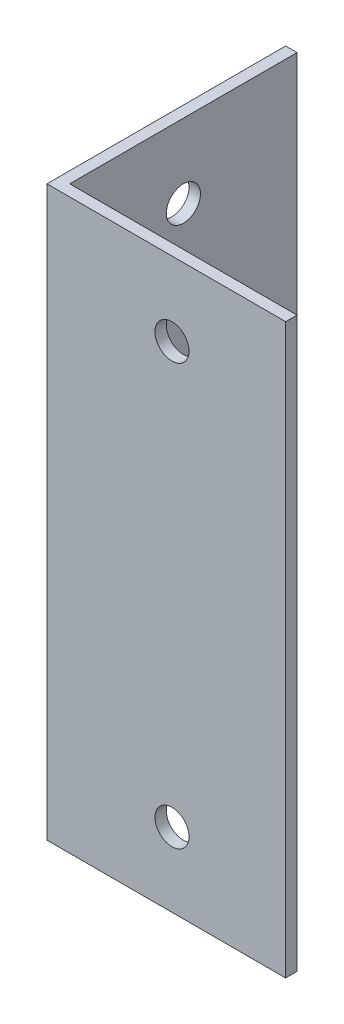
ISO-10303-21;
HEADER;
FILE_DESCRIPTION(('STEP AP214'),'2;1');
FILE_NAME('part.step','',(''),(''),'','','');
FILE_SCHEMA(('AUTOMOTIVE_DESIGN { 1 0 10303 214 1 1 1 1 }'));
ENDSEC;
DATA;
#1=APPLICATION_CONTEXT('core data for automotive mechanical design processes');
#2=APPLICATION_PROTOCOL_DEFINITION('international standard','automotive_design',2000,#1);
#3=PRODUCT_CONTEXT('',#1,'mechanical');
#4=PRODUCT('Part','Part','',(#3));
#5=PRODUCT_RELATED_PRODUCT_CATEGORY('part','',(#4));
#6=PRODUCT_DEFINITION_FORMATION('','',#4);
#7=PRODUCT_DEFINITION_CONTEXT('part definition',#1,'design');
#8=PRODUCT_DEFINITION('design','',#6,#7);
#9=PRODUCT_DEFINITION_SHAPE('','',#8);
#10=(LENGTH_UNIT() NAMED_UNIT(*) SI_UNIT(.MILLI.,.METRE.));
#11=(NAMED_UNIT(*) PLANE_ANGLE_UNIT() SI_UNIT($,.RADIAN.));
#12=(NAMED_UNIT(*) SI_UNIT($,.STERADIAN.) SOLID_ANGLE_UNIT());
#13=UNCERTAINTY_MEASURE_WITH_UNIT(LENGTH_MEASURE(1.E-05),#10,'distance_accuracy_value','');
#14=(GEOMETRIC_REPRESENTATION_CONTEXT(3) GLOBAL_UNCERTAINTY_ASSIGNED_CONTEXT((#13)) GLOBAL_UNIT_ASSIGNED_CONTEXT((#10,
#11,#12)) REPRESENTATION_CONTEXT('',''));
#15=CARTESIAN_POINT('',(0.,0.,0.));
#16=DIRECTION('',(0.,0.,1.));
#17=DIRECTION('',(1.,0.,0.));
#18=AXIS2_PLACEMENT_3D('',#15,#16,#17);
#19=CARTESIAN_POINT('',(21.,50.,0.));
#20=DIRECTION('',(0.,0.,-1.));
#21=DIRECTION('',(-1.,0.,0.));
#22=AXIS2_PLACEMENT_3D('',#19,#20,#21);
#23=PLANE('',#22);
#24=CARTESIAN_POINT('',(11.,6.50000000000001,0.));
#25=DIRECTION('',(0.,0.,-1.));
#26=DIRECTION('',(-1.,0.,0.));
#27=AXIS2_PLACEMENT_3D('',#24,#25,#26);
#28=CIRCLE('',#27,1.5);
#29=CARTESIAN_POINT('',(9.50000000000001,6.50000000000001,0.));
#30=VERTEX_POINT('',#29);
#31=EDGE_CURVE('E161',#30,#30,#28,.F.);
#32=ORIENTED_EDGE('',*,*,#31,.F.);
#33=EDGE_LOOP('',(#32));
#34=FACE_BOUND('',#33,.T.);
#35=CARTESIAN_POINT('',(11.,43.5,0.));
#36=DIRECTION('',(0.,0.,-1.));
#37=DIRECTION('',(-1.,0.,0.));
#38=AXIS2_PLACEMENT_3D('',#35,#36,#37);
#39=CIRCLE('',#38,1.5);
#40=CARTESIAN_POINT('',(9.50000000000001,43.5,0.));
#41=VERTEX_POINT('',#40);
#42=EDGE_CURVE('E164',#41,#41,#39,.F.);
#43=ORIENTED_EDGE('',*,*,#42,.F.);
#44=EDGE_LOOP('',(#43));
#45=FACE_BOUND('',#44,.T.);
#46=DIRECTION('',(1.,0.,0.));
#47=VECTOR('',#46,1.);
#48=CARTESIAN_POINT('',(21.,0.,0.));
#49=LINE('',#48,#47);
#50=CARTESIAN_POINT('',(0.,0.,0.));
#51=VERTEX_POINT('',#50);
#52=CARTESIAN_POINT('',(21.,0.,0.));
#53=VERTEX_POINT('',#52);
#54=EDGE_CURVE('E115',#51,#53,#49,.T.);
#55=ORIENTED_EDGE('',*,*,#54,.T.);
#56=DIRECTION('',(0.,-1.,0.));
#57=VECTOR('',#56,1.);
#58=CARTESIAN_POINT('',(21.,50.,0.));
#59=LINE('',#58,#57);
#60=CARTESIAN_POINT('',(21.,50.,0.));
#61=VERTEX_POINT('',#60);
#62=EDGE_CURVE('E11',#61,#53,#59,.T.);
#63=ORIENTED_EDGE('',*,*,#62,.F.);
#64=DIRECTION('',(1.,0.,0.));
#65=VECTOR('',#64,1.);
#66=CARTESIAN_POINT('',(21.,50.,0.));
#67=LINE('',#66,#65);
#68=CARTESIAN_POINT('',(0.,50.,0.));
#69=VERTEX_POINT('',#68);
#70=EDGE_CURVE('E126',#69,#61,#67,.T.);
#71=ORIENTED_EDGE('',*,*,#70,.F.);
#72=DIRECTION('',(0.,-1.,0.));
#73=VECTOR('',#72,1.);
#74=CARTESIAN_POINT('',(0.,50.,0.));
#75=LINE('',#74,#73);
#76=EDGE_CURVE('E111',#69,#51,#75,.T.);
#77=ORIENTED_EDGE('',*,*,#76,.T.);
#78=EDGE_LOOP('',(#55,#63,#71,#77));
#79=FACE_BOUND('',#78,.T.);
#80=ADVANCED_FACE('F31',(#34,#45,#79),#23,.F.);
#81=CARTESIAN_POINT('',(21.,50.,-1.00000000000009));
#82=DIRECTION('',(-1.,0.,0.));
#83=DIRECTION('',(0.,0.,1.));
#84=AXIS2_PLACEMENT_3D('',#81,#82,#83);
#85=PLANE('',#84);
#86=DIRECTION('',(0.,0.,-1.));
#87=VECTOR('',#86,1.);
#88=CARTESIAN_POINT('',(21.,0.,-1.00000000000009));
#89=LINE('',#88,#87);
#90=CARTESIAN_POINT('',(21.,0.,-1.00000000000009));
#91=VERTEX_POINT('',#90);
#92=EDGE_CURVE('E118',#53,#91,#89,.T.);
#93=ORIENTED_EDGE('',*,*,#92,.T.);
#94=DIRECTION('',(0.,-1.,0.));
#95=VECTOR('',#94,1.);
#96=CARTESIAN_POINT('',(21.,50.,-1.00000000000009));
#97=LINE('',#96,#95);
#98=CARTESIAN_POINT('',(21.,50.,-1.00000000000009));
#99=VERTEX_POINT('',#98);
#100=EDGE_CURVE('E39',#99,#91,#97,.T.);
#101=ORIENTED_EDGE('',*,*,#100,.F.);
#102=DIRECTION('',(0.,0.,-1.));
#103=VECTOR('',#102,1.);
#104=CARTESIAN_POINT('',(21.,50.,-1.00000000000009));
#105=LINE('',#104,#103);
#106=EDGE_CURVE('E84',#61,#99,#105,.T.);
#107=ORIENTED_EDGE('',*,*,#106,.F.);
#108=ORIENTED_EDGE('',*,*,#62,.T.);
#109=EDGE_LOOP('',(#93,#101,#107,#108));
#110=FACE_BOUND('',#109,.T.);
#111=ADVANCED_FACE('F153',(#110),#85,.F.);
#112=CARTESIAN_POINT('',(1.,50.,-1.));
#113=DIRECTION('',(0.,0.,1.));
#114=DIRECTION('',(1.,0.,0.));
#115=AXIS2_PLACEMENT_3D('',#112,#113,#114);
#116=PLANE('',#115);
#117=CARTESIAN_POINT('',(11.,6.50000000000001,-1.00000000000004));
#118=DIRECTION('',(0.,0.,-1.));
#119=DIRECTION('',(1.,0.,0.));
#120=AXIS2_PLACEMENT_3D('',#117,#118,#119);
#121=CIRCLE('',#120,1.5);
#122=CARTESIAN_POINT('',(12.5,6.50000000000001,-1.00000000000005));
#123=VERTEX_POINT('',#122);
#124=EDGE_CURVE('E210',#123,#123,#121,.T.);
#125=ORIENTED_EDGE('',*,*,#124,.F.);
#126=EDGE_LOOP('',(#125));
#127=FACE_BOUND('',#126,.T.);
#128=CARTESIAN_POINT('',(11.,43.5,-1.00000000000004));
#129=DIRECTION('',(0.,0.,-1.));
#130=DIRECTION('',(-1.,0.,0.));
#131=AXIS2_PLACEMENT_3D('',#128,#129,#130);
#132=CIRCLE('',#131,1.5);
#133=CARTESIAN_POINT('',(9.5,43.5,-1.00000000000004));
#134=VERTEX_POINT('',#133);
#135=EDGE_CURVE('E167',#134,#134,#132,.T.);
#136=ORIENTED_EDGE('',*,*,#135,.F.);
#137=EDGE_LOOP('',(#136));
#138=FACE_BOUND('',#137,.T.);
#139=DIRECTION('',(-1.,0.,0.));
#140=VECTOR('',#139,1.);
#141=CARTESIAN_POINT('',(1.,0.,-1.));
#142=LINE('',#141,#140);
#143=CARTESIAN_POINT('',(1.,0.,-1.));
#144=VERTEX_POINT('',#143);
#145=EDGE_CURVE('E121',#91,#144,#142,.T.);
#146=ORIENTED_EDGE('',*,*,#145,.T.);
#147=DIRECTION('',(0.,-1.,0.));
#148=VECTOR('',#147,1.);
#149=CARTESIAN_POINT('',(1.,50.,-1.));
#150=LINE('',#149,#148);
#151=CARTESIAN_POINT('',(1.,50.,-1.));
#152=VERTEX_POINT('',#151);
#153=EDGE_CURVE('E106',#152,#144,#150,.T.);
#154=ORIENTED_EDGE('',*,*,#153,.F.);
#155=DIRECTION('',(-1.,0.,0.));
#156=VECTOR('',#155,1.);
#157=CARTESIAN_POINT('',(1.,50.,-1.));
#158=LINE('',#157,#156);
#159=EDGE_CURVE('E97',#99,#152,#158,.T.);
#160=ORIENTED_EDGE('',*,*,#159,.F.);
#161=ORIENTED_EDGE('',*,*,#100,.T.);
#162=EDGE_LOOP('',(#146,#154,#160,#161));
#163=FACE_BOUND('',#162,.T.);
#164=ADVANCED_FACE('F132',(#127,#138,#163),#116,.F.);
#165=CARTESIAN_POINT('',(1.,50.,-21.));
#166=DIRECTION('',(-1.,0.,0.));
#167=DIRECTION('',(0.,0.,1.));
#168=AXIS2_PLACEMENT_3D('',#165,#166,#167);
#169=PLANE('',#168);
#170=CARTESIAN_POINT('',(1.,43.5,-11.));
#171=DIRECTION('',(1.,0.,0.));
#172=DIRECTION('',(0.,0.,1.));
#173=AXIS2_PLACEMENT_3D('',#170,#171,#172);
#174=CIRCLE('',#173,1.5);
#175=CARTESIAN_POINT('',(1.,43.5,-9.50000000000001));
#176=VERTEX_POINT('',#175);
#177=EDGE_CURVE('E166',#176,#176,#174,.T.);
#178=ORIENTED_EDGE('',*,*,#177,.F.);
#179=EDGE_LOOP('',(#178));
#180=FACE_BOUND('',#179,.T.);
#181=CARTESIAN_POINT('',(1.,6.5,-11.));
#182=DIRECTION('',(1.,0.,0.));
#183=DIRECTION('',(0.,0.,-1.));
#184=AXIS2_PLACEMENT_3D('',#181,#182,#183);
#185=CIRCLE('',#184,1.5);
#186=CARTESIAN_POINT('',(1.,6.5,-12.5));
#187=VERTEX_POINT('',#186);
#188=EDGE_CURVE('E178',#187,#187,#185,.T.);
#189=ORIENTED_EDGE('',*,*,#188,.F.);
#190=EDGE_LOOP('',(#189));
#191=FACE_BOUND('',#190,.T.);
#192=DIRECTION('',(0.,0.,-1.));
#193=VECTOR('',#192,1.);
#194=CARTESIAN_POINT('',(1.,0.,-21.));
#195=LINE('',#194,#193);
#196=CARTESIAN_POINT('',(1.,0.,-21.));
#197=VERTEX_POINT('',#196);
#198=EDGE_CURVE('E105',#144,#197,#195,.T.);
#199=ORIENTED_EDGE('',*,*,#198,.T.);
#200=DIRECTION('',(0.,-1.,0.));
#201=VECTOR('',#200,1.);
#202=CARTESIAN_POINT('',(1.,50.,-21.));
#203=LINE('',#202,#201);
#204=CARTESIAN_POINT('',(1.,50.,-21.));
#205=VERTEX_POINT('',#204);
#206=EDGE_CURVE('E102',#205,#197,#203,.T.);
#207=ORIENTED_EDGE('',*,*,#206,.F.);
#208=DIRECTION('',(0.,0.,-1.));
#209=VECTOR('',#208,1.);
#210=CARTESIAN_POINT('',(1.,50.,-21.));
#211=LINE('',#210,#209);
#212=EDGE_CURVE('E91',#152,#205,#211,.T.);
#213=ORIENTED_EDGE('',*,*,#212,.F.);
#214=ORIENTED_EDGE('',*,*,#153,.T.);
#215=EDGE_LOOP('',(#199,#207,#213,#214));
#216=FACE_BOUND('',#215,.T.);
#217=ADVANCED_FACE('F103',(#180,#191,#216),#169,.F.);
#218=CARTESIAN_POINT('',(0.,50.,-21.));
#219=DIRECTION('',(0.,0.,1.));
#220=DIRECTION('',(1.,0.,0.));
#221=AXIS2_PLACEMENT_3D('',#218,#219,#220);
#222=PLANE('',#221);
#223=DIRECTION('',(-1.,0.,0.));
#224=VECTOR('',#223,1.);
#225=CARTESIAN_POINT('',(0.,0.,-21.));
#226=LINE('',#225,#224);
#227=CARTESIAN_POINT('',(0.,0.,-21.));
#228=VERTEX_POINT('',#227);
#229=EDGE_CURVE('E70',#197,#228,#226,.T.);
#230=ORIENTED_EDGE('',*,*,#229,.T.);
#231=DIRECTION('',(0.,-1.,0.));
#232=VECTOR('',#231,1.);
#233=CARTESIAN_POINT('',(0.,50.,-21.));
#234=LINE('',#233,#232);
#235=CARTESIAN_POINT('',(0.,50.,-21.));
#236=VERTEX_POINT('',#235);
#237=EDGE_CURVE('E107',#236,#228,#234,.T.);
#238=ORIENTED_EDGE('',*,*,#237,.F.);
#239=DIRECTION('',(-1.,0.,0.));
#240=VECTOR('',#239,1.);
#241=CARTESIAN_POINT('',(0.,50.,-21.));
#242=LINE('',#241,#240);
#243=EDGE_CURVE('E95',#205,#236,#242,.T.);
#244=ORIENTED_EDGE('',*,*,#243,.F.);
#245=ORIENTED_EDGE('',*,*,#206,.T.);
#246=EDGE_LOOP('',(#230,#238,#244,#245));
#247=FACE_BOUND('',#246,.T.);
#248=ADVANCED_FACE('F109',(#247),#222,.F.);
#249=CARTESIAN_POINT('',(0.,50.,0.));
#250=DIRECTION('',(1.,0.,0.));
#251=DIRECTION('',(0.,0.,-1.));
#252=AXIS2_PLACEMENT_3D('',#249,#250,#251);
#253=PLANE('',#252);
#254=CARTESIAN_POINT('',(0.,43.5,-11.));
#255=DIRECTION('',(1.,0.,0.));
#256=DIRECTION('',(0.,0.,-1.));
#257=AXIS2_PLACEMENT_3D('',#254,#255,#256);
#258=CIRCLE('',#257,1.5);
#259=CARTESIAN_POINT('',(0.,43.5,-12.5));
#260=VERTEX_POINT('',#259);
#261=EDGE_CURVE('E170',#260,#260,#258,.F.);
#262=ORIENTED_EDGE('',*,*,#261,.F.);
#263=EDGE_LOOP('',(#262));
#264=FACE_BOUND('',#263,.T.);
#265=CARTESIAN_POINT('',(0.,6.5,-11.));
#266=DIRECTION('',(1.,0.,0.));
#267=DIRECTION('',(0.,0.,-1.));
#268=AXIS2_PLACEMENT_3D('',#265,#266,#267);
#269=CIRCLE('',#268,1.5);
#270=CARTESIAN_POINT('',(0.,6.5,-12.5));
#271=VERTEX_POINT('',#270);
#272=EDGE_CURVE('E119',#271,#271,#269,.F.);
#273=ORIENTED_EDGE('',*,*,#272,.F.);
#274=EDGE_LOOP('',(#273));
#275=FACE_BOUND('',#274,.T.);
#276=DIRECTION('',(0.,0.,1.));
#277=VECTOR('',#276,1.);
#278=CARTESIAN_POINT('',(0.,0.,0.));
#279=LINE('',#278,#277);
#280=EDGE_CURVE('E76',#228,#51,#279,.T.);
#281=ORIENTED_EDGE('',*,*,#280,.T.);
#282=ORIENTED_EDGE('',*,*,#76,.F.);
#283=DIRECTION('',(0.,0.,1.));
#284=VECTOR('',#283,1.);
#285=CARTESIAN_POINT('',(0.,50.,0.));
#286=LINE('',#285,#284);
#287=EDGE_CURVE('E47',#236,#69,#286,.T.);
#288=ORIENTED_EDGE('',*,*,#287,.F.);
#289=ORIENTED_EDGE('',*,*,#237,.T.);
#290=EDGE_LOOP('',(#281,#282,#288,#289));
#291=FACE_BOUND('',#290,.T.);
#292=ADVANCED_FACE('F139',(#264,#275,#291),#253,.F.);
#293=CARTESIAN_POINT('',(0.,50.,0.));
#294=DIRECTION('',(0.,-1.,0.));
#295=DIRECTION('',(0.,0.,-1.));
#296=AXIS2_PLACEMENT_3D('',#293,#294,#295);
#297=PLANE('',#296);
#298=ORIENTED_EDGE('',*,*,#70,.T.);
#299=ORIENTED_EDGE('',*,*,#106,.T.);
#300=ORIENTED_EDGE('',*,*,#159,.T.);
#301=ORIENTED_EDGE('',*,*,#212,.T.);
#302=ORIENTED_EDGE('',*,*,#243,.T.);
#303=ORIENTED_EDGE('',*,*,#287,.T.);
#304=EDGE_LOOP('',(#298,#299,#300,#301,#302,#303));
#305=FACE_BOUND('',#304,.T.);
#306=ADVANCED_FACE('F93',(#305),#297,.F.);
#307=CARTESIAN_POINT('',(0.,0.,0.));
#308=DIRECTION('',(0.,-1.,0.));
#309=DIRECTION('',(0.,0.,-1.));
#310=AXIS2_PLACEMENT_3D('',#307,#308,#309);
#311=PLANE('',#310);
#312=ORIENTED_EDGE('',*,*,#54,.F.);
#313=ORIENTED_EDGE('',*,*,#280,.F.);
#314=ORIENTED_EDGE('',*,*,#229,.F.);
#315=ORIENTED_EDGE('',*,*,#198,.F.);
#316=ORIENTED_EDGE('',*,*,#145,.F.);
#317=ORIENTED_EDGE('',*,*,#92,.F.);
#318=EDGE_LOOP('',(#312,#313,#314,#315,#316,#317));
#319=FACE_BOUND('',#318,.T.);
#320=ADVANCED_FACE('F135',(#319),#311,.T.);
#321=CARTESIAN_POINT('',(-0.00100000000000122,6.5,-11.));
#322=DIRECTION('',(1.,0.,0.));
#323=DIRECTION('',(0.,0.,-1.));
#324=AXIS2_PLACEMENT_3D('',#321,#322,#323);
#325=CYLINDRICAL_SURFACE('',#324,1.5);
#326=ORIENTED_EDGE('',*,*,#188,.T.);
#327=EDGE_LOOP('',(#326));
#328=FACE_BOUND('',#327,.T.);
#329=ORIENTED_EDGE('',*,*,#272,.T.);
#330=EDGE_LOOP('',(#329));
#331=FACE_BOUND('',#330,.T.);
#332=ADVANCED_FACE('F186',(#328,#331),#325,.F.);
#333=CARTESIAN_POINT('',(-0.00100000000000122,43.5,-11.));
#334=DIRECTION('',(1.,0.,0.));
#335=DIRECTION('',(0.,0.,-1.));
#336=AXIS2_PLACEMENT_3D('',#333,#334,#335);
#337=CYLINDRICAL_SURFACE('',#336,1.5);
#338=ORIENTED_EDGE('',*,*,#177,.T.);
#339=EDGE_LOOP('',(#338));
#340=FACE_BOUND('',#339,.T.);
#341=ORIENTED_EDGE('',*,*,#261,.T.);
#342=EDGE_LOOP('',(#341));
#343=FACE_BOUND('',#342,.T.);
#344=ADVANCED_FACE('F188',(#340,#343),#337,.F.);
#345=CARTESIAN_POINT('',(11.,43.5,0.00100000000004047));
#346=DIRECTION('',(0.,0.,-1.));
#347=DIRECTION('',(-1.,0.,0.));
#348=AXIS2_PLACEMENT_3D('',#345,#346,#347);
#349=CYLINDRICAL_SURFACE('',#348,1.5);
#350=ORIENTED_EDGE('',*,*,#135,.T.);
#351=EDGE_LOOP('',(#350));
#352=FACE_BOUND('',#351,.T.);
#353=ORIENTED_EDGE('',*,*,#42,.T.);
#354=EDGE_LOOP('',(#353));
#355=FACE_BOUND('',#354,.T.);
#356=ADVANCED_FACE('F195',(#352,#355),#349,.F.);
#357=CARTESIAN_POINT('',(11.,6.50000000000001,0.00100000000004047));
#358=DIRECTION('',(0.,0.,-1.));
#359=DIRECTION('',(-1.,0.,0.));
#360=AXIS2_PLACEMENT_3D('',#357,#358,#359);
#361=CYLINDRICAL_SURFACE('',#360,1.5);
#362=ORIENTED_EDGE('',*,*,#124,.T.);
#363=EDGE_LOOP('',(#362));
#364=FACE_BOUND('',#363,.T.);
#365=ORIENTED_EDGE('',*,*,#31,.T.);
#366=EDGE_LOOP('',(#365));
#367=FACE_BOUND('',#366,.T.);
#368=ADVANCED_FACE('F201',(#364,#367),#361,.F.);
#369=CLOSED_SHELL('',(#80,#111,#164,#217,#248,#292,#306,#320,#332,#344,#356,#368));
#370=MANIFOLD_SOLID_BREP('B2',#369);
#371=ADVANCED_BREP_SHAPE_REPRESENTATION('',(#18,#370),#14);
#372=SHAPE_DEFINITION_REPRESENTATION(#9,#371);
ENDSEC;
END-ISO-10303-21;
